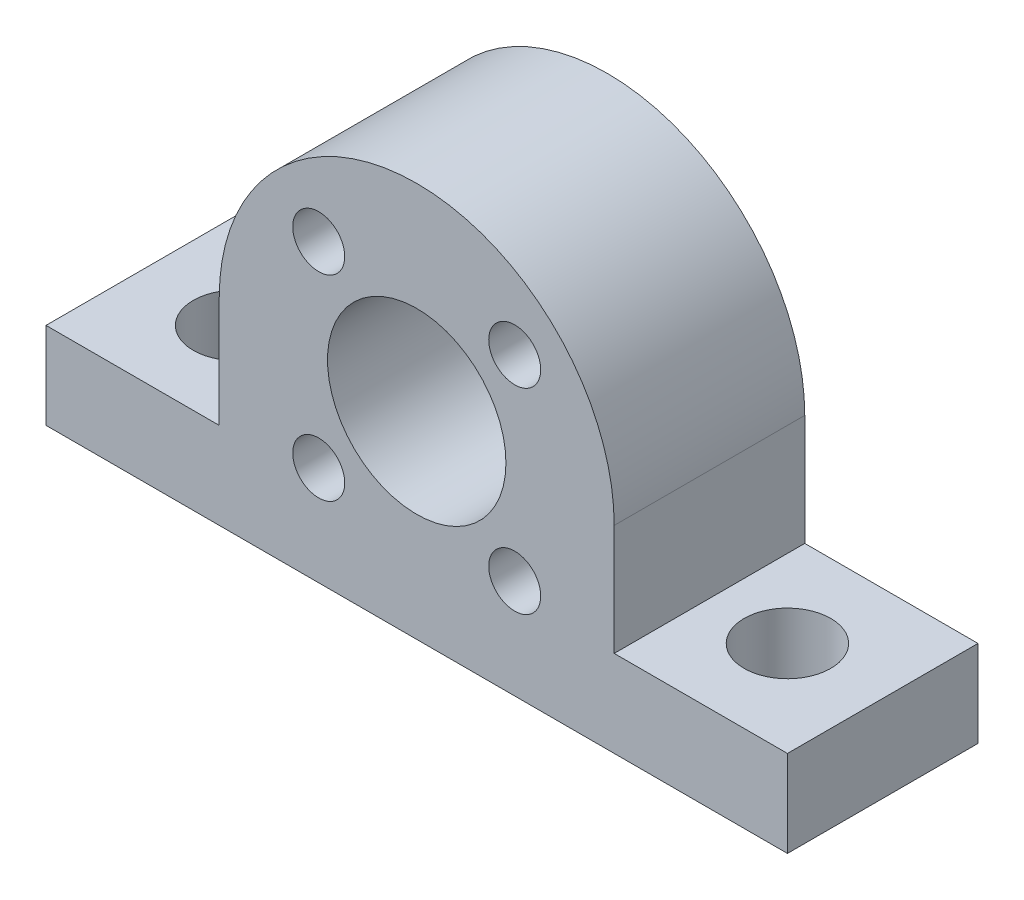
ISO-10303-21;
HEADER;
FILE_DESCRIPTION(('STEP AP214'),'2;1');
FILE_NAME('part.step','',(''),(''),'','','');
FILE_SCHEMA(('AUTOMOTIVE_DESIGN { 1 0 10303 214 1 1 1 1 }'));
ENDSEC;
DATA;
#1=APPLICATION_CONTEXT('core data for automotive mechanical design processes');
#2=APPLICATION_PROTOCOL_DEFINITION('international standard','automotive_design',2000,#1);
#3=PRODUCT_CONTEXT('',#1,'mechanical');
#4=PRODUCT('Part','Part','',(#3));
#5=PRODUCT_RELATED_PRODUCT_CATEGORY('part','',(#4));
#6=PRODUCT_DEFINITION_FORMATION('','',#4);
#7=PRODUCT_DEFINITION_CONTEXT('part definition',#1,'design');
#8=PRODUCT_DEFINITION('design','',#6,#7);
#9=PRODUCT_DEFINITION_SHAPE('','',#8);
#10=(LENGTH_UNIT() NAMED_UNIT(*) SI_UNIT(.MILLI.,.METRE.));
#11=(NAMED_UNIT(*) PLANE_ANGLE_UNIT() SI_UNIT($,.RADIAN.));
#12=(NAMED_UNIT(*) SI_UNIT($,.STERADIAN.) SOLID_ANGLE_UNIT());
#13=UNCERTAINTY_MEASURE_WITH_UNIT(LENGTH_MEASURE(1.E-05),#10,'distance_accuracy_value','');
#14=(GEOMETRIC_REPRESENTATION_CONTEXT(3) GLOBAL_UNCERTAINTY_ASSIGNED_CONTEXT((#13)) GLOBAL_UNIT_ASSIGNED_CONTEXT((#10,
#11,#12)) REPRESENTATION_CONTEXT('',''));
#15=CARTESIAN_POINT('',(0.,0.,0.));
#16=DIRECTION('',(0.,0.,1.));
#17=DIRECTION('',(1.,0.,0.));
#18=AXIS2_PLACEMENT_3D('',#15,#16,#17);
#19=CARTESIAN_POINT('',(0.,0.,11.));
#20=DIRECTION('',(0.,0.,-1.));
#21=DIRECTION('',(-1.,0.,0.));
#22=AXIS2_PLACEMENT_3D('',#19,#20,#21);
#23=PLANE('',#22);
#24=DIRECTION('',(0.,-1.,0.));
#25=VECTOR('',#24,1.);
#26=CARTESIAN_POINT('',(-21.4,-6.4,11.));
#27=LINE('',#26,#25);
#28=CARTESIAN_POINT('',(-21.4,-6.4,11.));
#29=VERTEX_POINT('',#28);
#30=CARTESIAN_POINT('',(-21.4,-11.4,11.));
#31=VERTEX_POINT('',#30);
#32=EDGE_CURVE('E149',#29,#31,#27,.T.);
#33=ORIENTED_EDGE('',*,*,#32,.T.);
#34=DIRECTION('',(1.,0.,0.));
#35=VECTOR('',#34,1.);
#36=CARTESIAN_POINT('',(-21.4,-11.4,11.));
#37=LINE('',#36,#35);
#38=CARTESIAN_POINT('',(21.4,-11.4,11.));
#39=VERTEX_POINT('',#38);
#40=EDGE_CURVE('E97',#31,#39,#37,.T.);
#41=ORIENTED_EDGE('',*,*,#40,.T.);
#42=DIRECTION('',(0.,1.,0.));
#43=VECTOR('',#42,1.);
#44=CARTESIAN_POINT('',(21.4,-6.4,11.));
#45=LINE('',#44,#43);
#46=CARTESIAN_POINT('',(21.4,-6.4,11.));
#47=VERTEX_POINT('',#46);
#48=EDGE_CURVE('E164',#39,#47,#45,.T.);
#49=ORIENTED_EDGE('',*,*,#48,.T.);
#50=DIRECTION('',(-1.,0.,0.));
#51=VECTOR('',#50,1.);
#52=CARTESIAN_POINT('',(21.4,-6.4,11.));
#53=LINE('',#52,#51);
#54=CARTESIAN_POINT('',(11.4,-6.4,11.));
#55=VERTEX_POINT('',#54);
#56=EDGE_CURVE('E177',#47,#55,#53,.T.);
#57=ORIENTED_EDGE('',*,*,#56,.T.);
#58=DIRECTION('',(0.,1.,0.));
#59=VECTOR('',#58,1.);
#60=CARTESIAN_POINT('',(11.4,0.,11.));
#61=LINE('',#60,#59);
#62=CARTESIAN_POINT('',(11.4,0.,11.));
#63=VERTEX_POINT('',#62);
#64=EDGE_CURVE('E116',#55,#63,#61,.T.);
#65=ORIENTED_EDGE('',*,*,#64,.T.);
#66=CARTESIAN_POINT('',(0.,0.,11.));
#67=DIRECTION('',(0.,0.,1.));
#68=DIRECTION('',(-1.,0.,0.));
#69=AXIS2_PLACEMENT_3D('',#66,#67,#68);
#70=CIRCLE('',#69,11.4);
#71=CARTESIAN_POINT('',(-11.4,0.,11.));
#72=VERTEX_POINT('',#71);
#73=EDGE_CURVE('E110',#63,#72,#70,.T.);
#74=ORIENTED_EDGE('',*,*,#73,.T.);
#75=DIRECTION('',(0.,-1.,0.));
#76=VECTOR('',#75,1.);
#77=CARTESIAN_POINT('',(-11.4,0.,11.));
#78=LINE('',#77,#76);
#79=CARTESIAN_POINT('',(-11.4,-6.4,11.));
#80=VERTEX_POINT('',#79);
#81=EDGE_CURVE('E114',#72,#80,#78,.T.);
#82=ORIENTED_EDGE('',*,*,#81,.T.);
#83=DIRECTION('',(-1.,0.,0.));
#84=VECTOR('',#83,1.);
#85=CARTESIAN_POINT('',(-21.4,-6.4,11.));
#86=LINE('',#85,#84);
#87=EDGE_CURVE('E54',#80,#29,#86,.T.);
#88=ORIENTED_EDGE('',*,*,#87,.T.);
#89=EDGE_LOOP('',(#33,#41,#49,#57,#65,#74,#82,#88));
#90=FACE_BOUND('',#89,.T.);
#91=CARTESIAN_POINT('',(0.,0.,11.));
#92=DIRECTION('',(0.,0.,1.));
#93=DIRECTION('',(1.,0.,0.));
#94=AXIS2_PLACEMENT_3D('',#91,#92,#93);
#95=CIRCLE('',#94,5.15);
#96=CARTESIAN_POINT('',(5.15,0.,11.));
#97=VERTEX_POINT('',#96);
#98=EDGE_CURVE('E138',#97,#97,#95,.T.);
#99=ORIENTED_EDGE('',*,*,#98,.F.);
#100=EDGE_LOOP('',(#99));
#101=FACE_BOUND('',#100,.T.);
#102=CARTESIAN_POINT('',(-5.65685424949235,5.65685424949241,11.));
#103=DIRECTION('',(0.,0.,1.));
#104=DIRECTION('',(1.,0.,0.));
#105=AXIS2_PLACEMENT_3D('',#102,#103,#104);
#106=CIRCLE('',#105,1.5);
#107=CARTESIAN_POINT('',(-4.15685424949235,5.65685424949241,11.));
#108=VERTEX_POINT('',#107);
#109=EDGE_CURVE('E186',#108,#108,#106,.T.);
#110=ORIENTED_EDGE('',*,*,#109,.F.);
#111=EDGE_LOOP('',(#110));
#112=FACE_BOUND('',#111,.T.);
#113=CARTESIAN_POINT('',(5.65685424949235,5.65685424949241,11.));
#114=DIRECTION('',(0.,0.,1.));
#115=DIRECTION('',(-1.,0.,0.));
#116=AXIS2_PLACEMENT_3D('',#113,#114,#115);
#117=CIRCLE('',#116,1.5);
#118=CARTESIAN_POINT('',(4.15685424949235,5.65685424949241,11.));
#119=VERTEX_POINT('',#118);
#120=EDGE_CURVE('E192',#119,#119,#117,.T.);
#121=ORIENTED_EDGE('',*,*,#120,.F.);
#122=EDGE_LOOP('',(#121));
#123=FACE_BOUND('',#122,.T.);
#124=CARTESIAN_POINT('',(-5.65685424949235,-5.65685424949241,11.));
#125=DIRECTION('',(0.,0.,1.));
#126=DIRECTION('',(-1.,0.,0.));
#127=AXIS2_PLACEMENT_3D('',#124,#125,#126);
#128=CIRCLE('',#127,1.5);
#129=CARTESIAN_POINT('',(-7.15685424949235,-5.65685424949241,11.));
#130=VERTEX_POINT('',#129);
#131=EDGE_CURVE('E198',#130,#130,#128,.T.);
#132=ORIENTED_EDGE('',*,*,#131,.F.);
#133=EDGE_LOOP('',(#132));
#134=FACE_BOUND('',#133,.T.);
#135=CARTESIAN_POINT('',(5.65685424949235,-5.65685424949241,11.));
#136=DIRECTION('',(0.,0.,1.));
#137=DIRECTION('',(1.,0.,0.));
#138=AXIS2_PLACEMENT_3D('',#135,#136,#137);
#139=CIRCLE('',#138,1.5);
#140=CARTESIAN_POINT('',(7.15685424949235,-5.65685424949241,11.));
#141=VERTEX_POINT('',#140);
#142=EDGE_CURVE('E204',#141,#141,#139,.T.);
#143=ORIENTED_EDGE('',*,*,#142,.F.);
#144=EDGE_LOOP('',(#143));
#145=FACE_BOUND('',#144,.T.);
#146=ADVANCED_FACE('F37',(#90,#101,#112,#123,#134,#145),#23,.F.);
#147=CARTESIAN_POINT('',(0.,0.,0.));
#148=DIRECTION('',(0.,0.,-1.));
#149=DIRECTION('',(-1.,0.,0.));
#150=AXIS2_PLACEMENT_3D('',#147,#148,#149);
#151=PLANE('',#150);
#152=CARTESIAN_POINT('',(-5.65685424949235,-5.65685424949241,0.));
#153=DIRECTION('',(0.,0.,1.));
#154=DIRECTION('',(-1.,0.,0.));
#155=AXIS2_PLACEMENT_3D('',#152,#153,#154);
#156=CIRCLE('',#155,1.5);
#157=CARTESIAN_POINT('',(-7.15685424949235,-5.65685424949241,0.));
#158=VERTEX_POINT('',#157);
#159=EDGE_CURVE('E201',#158,#158,#156,.T.);
#160=ORIENTED_EDGE('',*,*,#159,.T.);
#161=EDGE_LOOP('',(#160));
#162=FACE_BOUND('',#161,.T.);
#163=CARTESIAN_POINT('',(-5.65685424949235,5.65685424949241,0.));
#164=DIRECTION('',(0.,0.,1.));
#165=DIRECTION('',(1.,0.,0.));
#166=AXIS2_PLACEMENT_3D('',#163,#164,#165);
#167=CIRCLE('',#166,1.5);
#168=CARTESIAN_POINT('',(-4.15685424949235,5.65685424949241,0.));
#169=VERTEX_POINT('',#168);
#170=EDGE_CURVE('E189',#169,#169,#167,.T.);
#171=ORIENTED_EDGE('',*,*,#170,.T.);
#172=EDGE_LOOP('',(#171));
#173=FACE_BOUND('',#172,.T.);
#174=DIRECTION('',(0.,-1.,0.));
#175=VECTOR('',#174,1.);
#176=CARTESIAN_POINT('',(-21.4,-6.4,0.));
#177=LINE('',#176,#175);
#178=CARTESIAN_POINT('',(-21.4,-6.4,0.));
#179=VERTEX_POINT('',#178);
#180=CARTESIAN_POINT('',(-21.4,-11.4,0.));
#181=VERTEX_POINT('',#180);
#182=EDGE_CURVE('E134',#179,#181,#177,.T.);
#183=ORIENTED_EDGE('',*,*,#182,.F.);
#184=DIRECTION('',(-1.,0.,0.));
#185=VECTOR('',#184,1.);
#186=CARTESIAN_POINT('',(-21.4,-6.4,0.));
#187=LINE('',#186,#185);
#188=CARTESIAN_POINT('',(-11.4,-6.4,0.));
#189=VERTEX_POINT('',#188);
#190=EDGE_CURVE('E89',#189,#179,#187,.T.);
#191=ORIENTED_EDGE('',*,*,#190,.F.);
#192=DIRECTION('',(0.,-1.,0.));
#193=VECTOR('',#192,1.);
#194=CARTESIAN_POINT('',(-11.4,0.,0.));
#195=LINE('',#194,#193);
#196=CARTESIAN_POINT('',(-11.4,0.,0.));
#197=VERTEX_POINT('',#196);
#198=EDGE_CURVE('E83',#197,#189,#195,.T.);
#199=ORIENTED_EDGE('',*,*,#198,.F.);
#200=CARTESIAN_POINT('',(0.,0.,0.));
#201=DIRECTION('',(0.,0.,1.));
#202=DIRECTION('',(-1.,0.,0.));
#203=AXIS2_PLACEMENT_3D('',#200,#201,#202);
#204=CIRCLE('',#203,11.4);
#205=CARTESIAN_POINT('',(11.4,0.,0.));
#206=VERTEX_POINT('',#205);
#207=EDGE_CURVE('E124',#206,#197,#204,.T.);
#208=ORIENTED_EDGE('',*,*,#207,.F.);
#209=DIRECTION('',(0.,1.,0.));
#210=VECTOR('',#209,1.);
#211=CARTESIAN_POINT('',(11.4,0.,0.));
#212=LINE('',#211,#210);
#213=CARTESIAN_POINT('',(11.4,-6.4,0.));
#214=VERTEX_POINT('',#213);
#215=EDGE_CURVE('E144',#214,#206,#212,.T.);
#216=ORIENTED_EDGE('',*,*,#215,.F.);
#217=DIRECTION('',(-1.,0.,0.));
#218=VECTOR('',#217,1.);
#219=CARTESIAN_POINT('',(21.4,-6.4,0.));
#220=LINE('',#219,#218);
#221=CARTESIAN_POINT('',(21.4,-6.4,0.));
#222=VERTEX_POINT('',#221);
#223=EDGE_CURVE('E142',#222,#214,#220,.T.);
#224=ORIENTED_EDGE('',*,*,#223,.F.);
#225=DIRECTION('',(0.,1.,0.));
#226=VECTOR('',#225,1.);
#227=CARTESIAN_POINT('',(21.4,-6.4,0.));
#228=LINE('',#227,#226);
#229=CARTESIAN_POINT('',(21.4,-11.4,0.));
#230=VERTEX_POINT('',#229);
#231=EDGE_CURVE('E140',#230,#222,#228,.T.);
#232=ORIENTED_EDGE('',*,*,#231,.F.);
#233=DIRECTION('',(1.,0.,0.));
#234=VECTOR('',#233,1.);
#235=CARTESIAN_POINT('',(-21.4,-11.4,0.));
#236=LINE('',#235,#234);
#237=EDGE_CURVE('E137',#181,#230,#236,.T.);
#238=ORIENTED_EDGE('',*,*,#237,.F.);
#239=EDGE_LOOP('',(#183,#191,#199,#208,#216,#224,#232,#238));
#240=FACE_BOUND('',#239,.T.);
#241=CARTESIAN_POINT('',(0.,0.,0.));
#242=DIRECTION('',(0.,0.,1.));
#243=DIRECTION('',(1.,0.,0.));
#244=AXIS2_PLACEMENT_3D('',#241,#242,#243);
#245=CIRCLE('',#244,5.15);
#246=CARTESIAN_POINT('',(5.15,0.,0.));
#247=VERTEX_POINT('',#246);
#248=EDGE_CURVE('E183',#247,#247,#245,.T.);
#249=ORIENTED_EDGE('',*,*,#248,.T.);
#250=EDGE_LOOP('',(#249));
#251=FACE_BOUND('',#250,.T.);
#252=CARTESIAN_POINT('',(5.65685424949235,5.65685424949241,0.));
#253=DIRECTION('',(0.,0.,1.));
#254=DIRECTION('',(-1.,0.,0.));
#255=AXIS2_PLACEMENT_3D('',#252,#253,#254);
#256=CIRCLE('',#255,1.5);
#257=CARTESIAN_POINT('',(4.15685424949235,5.65685424949241,0.));
#258=VERTEX_POINT('',#257);
#259=EDGE_CURVE('E195',#258,#258,#256,.T.);
#260=ORIENTED_EDGE('',*,*,#259,.T.);
#261=EDGE_LOOP('',(#260));
#262=FACE_BOUND('',#261,.T.);
#263=CARTESIAN_POINT('',(5.65685424949235,-5.65685424949241,0.));
#264=DIRECTION('',(0.,0.,1.));
#265=DIRECTION('',(1.,0.,0.));
#266=AXIS2_PLACEMENT_3D('',#263,#264,#265);
#267=CIRCLE('',#266,1.5);
#268=CARTESIAN_POINT('',(7.15685424949235,-5.65685424949241,0.));
#269=VERTEX_POINT('',#268);
#270=EDGE_CURVE('E207',#269,#269,#267,.T.);
#271=ORIENTED_EDGE('',*,*,#270,.T.);
#272=EDGE_LOOP('',(#271));
#273=FACE_BOUND('',#272,.T.);
#274=ADVANCED_FACE('F168',(#162,#173,#240,#251,#262,#273),#151,.T.);
#275=CARTESIAN_POINT('',(-21.4,-6.4,11.));
#276=DIRECTION('',(1.,0.,0.));
#277=DIRECTION('',(0.,0.,-1.));
#278=AXIS2_PLACEMENT_3D('',#275,#276,#277);
#279=PLANE('',#278);
#280=ORIENTED_EDGE('',*,*,#182,.T.);
#281=DIRECTION('',(0.,0.,-1.));
#282=VECTOR('',#281,1.);
#283=CARTESIAN_POINT('',(-21.4,-11.4,11.));
#284=LINE('',#283,#282);
#285=EDGE_CURVE('E11',#31,#181,#284,.T.);
#286=ORIENTED_EDGE('',*,*,#285,.F.);
#287=ORIENTED_EDGE('',*,*,#32,.F.);
#288=DIRECTION('',(0.,0.,-1.));
#289=VECTOR('',#288,1.);
#290=CARTESIAN_POINT('',(-21.4,-6.4,11.));
#291=LINE('',#290,#289);
#292=EDGE_CURVE('E130',#29,#179,#291,.T.);
#293=ORIENTED_EDGE('',*,*,#292,.T.);
#294=EDGE_LOOP('',(#280,#286,#287,#293));
#295=FACE_BOUND('',#294,.T.);
#296=ADVANCED_FACE('F39',(#295),#279,.F.);
#297=CARTESIAN_POINT('',(-21.4,-11.4,11.));
#298=DIRECTION('',(0.,1.,0.));
#299=DIRECTION('',(-1.,0.,0.));
#300=AXIS2_PLACEMENT_3D('',#297,#298,#299);
#301=PLANE('',#300);
#302=CARTESIAN_POINT('',(-15.9,-11.4,5.5));
#303=DIRECTION('',(0.,1.,0.));
#304=DIRECTION('',(0.,0.,1.));
#305=AXIS2_PLACEMENT_3D('',#302,#303,#304);
#306=CIRCLE('',#305,2.5);
#307=CARTESIAN_POINT('',(-15.9,-11.4,8.));
#308=VERTEX_POINT('',#307);
#309=EDGE_CURVE('E210',#308,#308,#306,.T.);
#310=ORIENTED_EDGE('',*,*,#309,.T.);
#311=EDGE_LOOP('',(#310));
#312=FACE_BOUND('',#311,.T.);
#313=CARTESIAN_POINT('',(15.9,-11.4,5.5));
#314=DIRECTION('',(0.,1.,0.));
#315=DIRECTION('',(0.,0.,-1.));
#316=AXIS2_PLACEMENT_3D('',#313,#314,#315);
#317=CIRCLE('',#316,2.5);
#318=CARTESIAN_POINT('',(15.9,-11.4,3.));
#319=VERTEX_POINT('',#318);
#320=EDGE_CURVE('E216',#319,#319,#317,.T.);
#321=ORIENTED_EDGE('',*,*,#320,.T.);
#322=EDGE_LOOP('',(#321));
#323=FACE_BOUND('',#322,.T.);
#324=ORIENTED_EDGE('',*,*,#237,.T.);
#325=DIRECTION('',(0.,0.,-1.));
#326=VECTOR('',#325,1.);
#327=CARTESIAN_POINT('',(21.4,-11.4,11.));
#328=LINE('',#327,#326);
#329=EDGE_CURVE('E46',#39,#230,#328,.T.);
#330=ORIENTED_EDGE('',*,*,#329,.F.);
#331=ORIENTED_EDGE('',*,*,#40,.F.);
#332=ORIENTED_EDGE('',*,*,#285,.T.);
#333=EDGE_LOOP('',(#324,#330,#331,#332));
#334=FACE_BOUND('',#333,.T.);
#335=ADVANCED_FACE('F225',(#312,#323,#334),#301,.F.);
#336=CARTESIAN_POINT('',(21.4,-6.4,11.));
#337=DIRECTION('',(-1.,0.,0.));
#338=DIRECTION('',(0.,0.,1.));
#339=AXIS2_PLACEMENT_3D('',#336,#337,#338);
#340=PLANE('',#339);
#341=ORIENTED_EDGE('',*,*,#231,.T.);
#342=DIRECTION('',(0.,0.,-1.));
#343=VECTOR('',#342,1.);
#344=CARTESIAN_POINT('',(21.4,-6.4,11.));
#345=LINE('',#344,#343);
#346=EDGE_CURVE('E156',#47,#222,#345,.T.);
#347=ORIENTED_EDGE('',*,*,#346,.F.);
#348=ORIENTED_EDGE('',*,*,#48,.F.);
#349=ORIENTED_EDGE('',*,*,#329,.T.);
#350=EDGE_LOOP('',(#341,#347,#348,#349));
#351=FACE_BOUND('',#350,.T.);
#352=ADVANCED_FACE('F162',(#351),#340,.F.);
#353=CARTESIAN_POINT('',(21.4,-6.4,11.));
#354=DIRECTION('',(0.,-1.,0.));
#355=DIRECTION('',(1.,0.,0.));
#356=AXIS2_PLACEMENT_3D('',#353,#354,#355);
#357=PLANE('',#356);
#358=CARTESIAN_POINT('',(15.9,-6.4,5.5));
#359=DIRECTION('',(0.,1.,0.));
#360=DIRECTION('',(0.,0.,-1.));
#361=AXIS2_PLACEMENT_3D('',#358,#359,#360);
#362=CIRCLE('',#361,2.5);
#363=CARTESIAN_POINT('',(15.9,-6.4,3.));
#364=VERTEX_POINT('',#363);
#365=EDGE_CURVE('E213',#364,#364,#362,.T.);
#366=ORIENTED_EDGE('',*,*,#365,.F.);
#367=EDGE_LOOP('',(#366));
#368=FACE_BOUND('',#367,.T.);
#369=ORIENTED_EDGE('',*,*,#223,.T.);
#370=DIRECTION('',(0.,0.,-1.));
#371=VECTOR('',#370,1.);
#372=CARTESIAN_POINT('',(11.4,-6.4,11.));
#373=LINE('',#372,#371);
#374=EDGE_CURVE('E153',#55,#214,#373,.T.);
#375=ORIENTED_EDGE('',*,*,#374,.F.);
#376=ORIENTED_EDGE('',*,*,#56,.F.);
#377=ORIENTED_EDGE('',*,*,#346,.T.);
#378=EDGE_LOOP('',(#369,#375,#376,#377));
#379=FACE_BOUND('',#378,.T.);
#380=ADVANCED_FACE('F173',(#368,#379),#357,.F.);
#381=CARTESIAN_POINT('',(11.4,0.,11.));
#382=DIRECTION('',(-1.,0.,0.));
#383=DIRECTION('',(0.,0.,1.));
#384=AXIS2_PLACEMENT_3D('',#381,#382,#383);
#385=PLANE('',#384);
#386=ORIENTED_EDGE('',*,*,#215,.T.);
#387=DIRECTION('',(0.,0.,-1.));
#388=VECTOR('',#387,1.);
#389=CARTESIAN_POINT('',(11.4,0.,11.));
#390=LINE('',#389,#388);
#391=EDGE_CURVE('E125',#63,#206,#390,.T.);
#392=ORIENTED_EDGE('',*,*,#391,.F.);
#393=ORIENTED_EDGE('',*,*,#64,.F.);
#394=ORIENTED_EDGE('',*,*,#374,.T.);
#395=EDGE_LOOP('',(#386,#392,#393,#394));
#396=FACE_BOUND('',#395,.T.);
#397=ADVANCED_FACE('F176',(#396),#385,.F.);
#398=CARTESIAN_POINT('',(0.,0.,11.));
#399=DIRECTION('',(0.,0.,-1.));
#400=DIRECTION('',(-1.,0.,0.));
#401=AXIS2_PLACEMENT_3D('',#398,#399,#400);
#402=CYLINDRICAL_SURFACE('',#401,11.4);
#403=ORIENTED_EDGE('',*,*,#207,.T.);
#404=DIRECTION('',(0.,0.,-1.));
#405=VECTOR('',#404,1.);
#406=CARTESIAN_POINT('',(-11.4,0.,11.));
#407=LINE('',#406,#405);
#408=EDGE_CURVE('E121',#72,#197,#407,.T.);
#409=ORIENTED_EDGE('',*,*,#408,.F.);
#410=ORIENTED_EDGE('',*,*,#73,.F.);
#411=ORIENTED_EDGE('',*,*,#391,.T.);
#412=EDGE_LOOP('',(#403,#409,#410,#411));
#413=FACE_BOUND('',#412,.T.);
#414=ADVANCED_FACE('F122',(#413),#402,.T.);
#415=CARTESIAN_POINT('',(-11.4,0.,11.));
#416=DIRECTION('',(1.,0.,0.));
#417=DIRECTION('',(0.,0.,-1.));
#418=AXIS2_PLACEMENT_3D('',#415,#416,#417);
#419=PLANE('',#418);
#420=ORIENTED_EDGE('',*,*,#198,.T.);
#421=DIRECTION('',(0.,0.,-1.));
#422=VECTOR('',#421,1.);
#423=CARTESIAN_POINT('',(-11.4,-6.4,11.));
#424=LINE('',#423,#422);
#425=EDGE_CURVE('E126',#80,#189,#424,.T.);
#426=ORIENTED_EDGE('',*,*,#425,.F.);
#427=ORIENTED_EDGE('',*,*,#81,.F.);
#428=ORIENTED_EDGE('',*,*,#408,.T.);
#429=EDGE_LOOP('',(#420,#426,#427,#428));
#430=FACE_BOUND('',#429,.T.);
#431=ADVANCED_FACE('F128',(#430),#419,.F.);
#432=CARTESIAN_POINT('',(-21.4,-6.4,11.));
#433=DIRECTION('',(0.,-1.,0.));
#434=DIRECTION('',(0.,0.,-1.));
#435=AXIS2_PLACEMENT_3D('',#432,#433,#434);
#436=PLANE('',#435);
#437=CARTESIAN_POINT('',(-15.9,-6.4,5.5));
#438=DIRECTION('',(0.,1.,0.));
#439=DIRECTION('',(0.,0.,1.));
#440=AXIS2_PLACEMENT_3D('',#437,#438,#439);
#441=CIRCLE('',#440,2.5);
#442=CARTESIAN_POINT('',(-15.9,-6.4,8.));
#443=VERTEX_POINT('',#442);
#444=EDGE_CURVE('E219',#443,#443,#441,.T.);
#445=ORIENTED_EDGE('',*,*,#444,.F.);
#446=EDGE_LOOP('',(#445));
#447=FACE_BOUND('',#446,.T.);
#448=ORIENTED_EDGE('',*,*,#190,.T.);
#449=ORIENTED_EDGE('',*,*,#292,.F.);
#450=ORIENTED_EDGE('',*,*,#87,.F.);
#451=ORIENTED_EDGE('',*,*,#425,.T.);
#452=EDGE_LOOP('',(#448,#449,#450,#451));
#453=FACE_BOUND('',#452,.T.);
#454=ADVANCED_FACE('F236',(#447,#453),#436,.F.);
#455=CARTESIAN_POINT('',(0.,0.,11.));
#456=DIRECTION('',(0.,0.,-1.));
#457=DIRECTION('',(-1.,0.,0.));
#458=AXIS2_PLACEMENT_3D('',#455,#456,#457);
#459=CYLINDRICAL_SURFACE('',#458,5.15);
#460=ORIENTED_EDGE('',*,*,#98,.T.);
#461=EDGE_LOOP('',(#460));
#462=FACE_BOUND('',#461,.T.);
#463=ORIENTED_EDGE('',*,*,#248,.F.);
#464=EDGE_LOOP('',(#463));
#465=FACE_BOUND('',#464,.T.);
#466=ADVANCED_FACE('F238',(#462,#465),#459,.F.);
#467=CARTESIAN_POINT('',(-5.65685424949235,5.65685424949241,11.));
#468=DIRECTION('',(0.,0.,-1.));
#469=DIRECTION('',(-1.,0.,0.));
#470=AXIS2_PLACEMENT_3D('',#467,#468,#469);
#471=CYLINDRICAL_SURFACE('',#470,1.5);
#472=ORIENTED_EDGE('',*,*,#109,.T.);
#473=EDGE_LOOP('',(#472));
#474=FACE_BOUND('',#473,.T.);
#475=ORIENTED_EDGE('',*,*,#170,.F.);
#476=EDGE_LOOP('',(#475));
#477=FACE_BOUND('',#476,.T.);
#478=ADVANCED_FACE('F244',(#474,#477),#471,.F.);
#479=CARTESIAN_POINT('',(5.65685424949235,5.65685424949241,11.));
#480=DIRECTION('',(0.,0.,-1.));
#481=DIRECTION('',(-1.,0.,0.));
#482=AXIS2_PLACEMENT_3D('',#479,#480,#481);
#483=CYLINDRICAL_SURFACE('',#482,1.5);
#484=ORIENTED_EDGE('',*,*,#120,.T.);
#485=EDGE_LOOP('',(#484));
#486=FACE_BOUND('',#485,.T.);
#487=ORIENTED_EDGE('',*,*,#259,.F.);
#488=EDGE_LOOP('',(#487));
#489=FACE_BOUND('',#488,.T.);
#490=ADVANCED_FACE('F258',(#486,#489),#483,.F.);
#491=CARTESIAN_POINT('',(-5.65685424949235,-5.65685424949241,11.));
#492=DIRECTION('',(0.,0.,-1.));
#493=DIRECTION('',(-1.,0.,0.));
#494=AXIS2_PLACEMENT_3D('',#491,#492,#493);
#495=CYLINDRICAL_SURFACE('',#494,1.5);
#496=ORIENTED_EDGE('',*,*,#131,.T.);
#497=EDGE_LOOP('',(#496));
#498=FACE_BOUND('',#497,.T.);
#499=ORIENTED_EDGE('',*,*,#159,.F.);
#500=EDGE_LOOP('',(#499));
#501=FACE_BOUND('',#500,.T.);
#502=ADVANCED_FACE('F262',(#498,#501),#495,.F.);
#503=CARTESIAN_POINT('',(5.65685424949235,-5.65685424949241,11.));
#504=DIRECTION('',(0.,0.,-1.));
#505=DIRECTION('',(-1.,0.,0.));
#506=AXIS2_PLACEMENT_3D('',#503,#504,#505);
#507=CYLINDRICAL_SURFACE('',#506,1.5);
#508=ORIENTED_EDGE('',*,*,#142,.T.);
#509=EDGE_LOOP('',(#508));
#510=FACE_BOUND('',#509,.T.);
#511=ORIENTED_EDGE('',*,*,#270,.F.);
#512=EDGE_LOOP('',(#511));
#513=FACE_BOUND('',#512,.T.);
#514=ADVANCED_FACE('F232',(#510,#513),#507,.F.);
#515=CARTESIAN_POINT('',(-15.9,-11.4,5.5));
#516=DIRECTION('',(0.,1.,0.));
#517=DIRECTION('',(0.,0.,1.));
#518=AXIS2_PLACEMENT_3D('',#515,#516,#517);
#519=CYLINDRICAL_SURFACE('',#518,2.5);
#520=ORIENTED_EDGE('',*,*,#309,.F.);
#521=EDGE_LOOP('',(#520));
#522=FACE_BOUND('',#521,.T.);
#523=ORIENTED_EDGE('',*,*,#444,.T.);
#524=EDGE_LOOP('',(#523));
#525=FACE_BOUND('',#524,.T.);
#526=ADVANCED_FACE('F228',(#522,#525),#519,.F.);
#527=CARTESIAN_POINT('',(15.9,-11.4,5.5));
#528=DIRECTION('',(0.,1.,0.));
#529=DIRECTION('',(0.,0.,1.));
#530=AXIS2_PLACEMENT_3D('',#527,#528,#529);
#531=CYLINDRICAL_SURFACE('',#530,2.5);
#532=ORIENTED_EDGE('',*,*,#320,.F.);
#533=EDGE_LOOP('',(#532));
#534=FACE_BOUND('',#533,.T.);
#535=ORIENTED_EDGE('',*,*,#365,.T.);
#536=EDGE_LOOP('',(#535));
#537=FACE_BOUND('',#536,.T.);
#538=ADVANCED_FACE('F231',(#534,#537),#531,.F.);
#539=CLOSED_SHELL('',(#146,#274,#296,#335,#352,#380,#397,#414,#431,#454,#466,#478,#490,#502,
#514,#526,#538));
#540=MANIFOLD_SOLID_BREP('B2',#539);
#541=ADVANCED_BREP_SHAPE_REPRESENTATION('',(#18,#540),#14);
#542=SHAPE_DEFINITION_REPRESENTATION(#9,#541);
ENDSEC;
END-ISO-10303-21;
